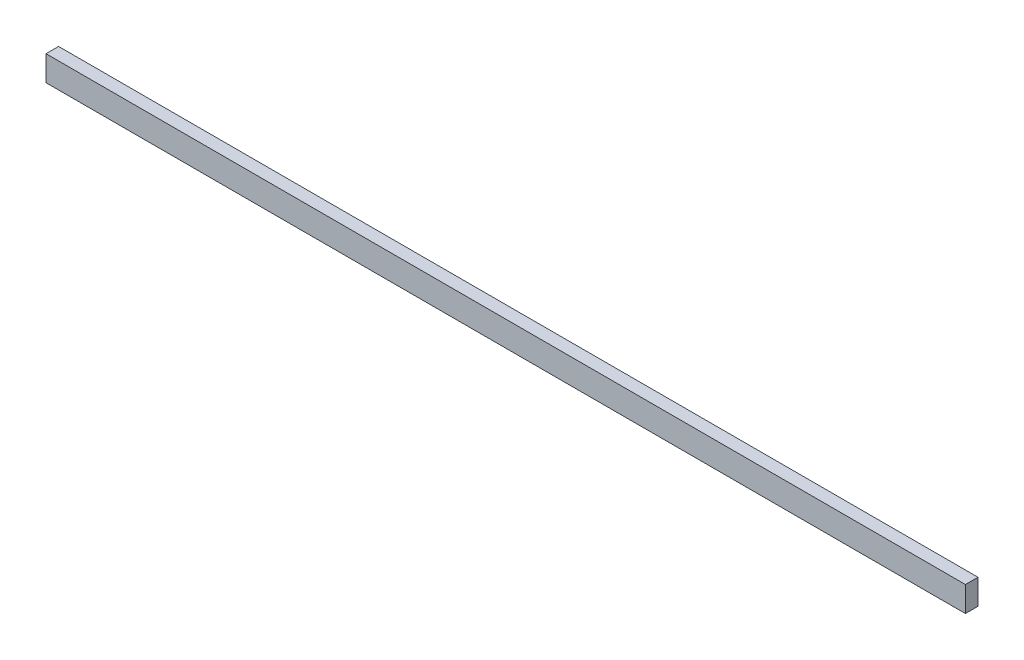
ISO-10303-21;
HEADER;
FILE_DESCRIPTION(('STEP AP214'),'2;1');
FILE_NAME('part.step','',(''),(''),'','','');
FILE_SCHEMA(('AUTOMOTIVE_DESIGN { 1 0 10303 214 1 1 1 1 }'));
ENDSEC;
DATA;
#1=APPLICATION_CONTEXT('core data for automotive mechanical design processes');
#2=APPLICATION_PROTOCOL_DEFINITION('international standard','automotive_design',2000,#1);
#3=PRODUCT_CONTEXT('',#1,'mechanical');
#4=PRODUCT('Part','Part','',(#3));
#5=PRODUCT_RELATED_PRODUCT_CATEGORY('part','',(#4));
#6=PRODUCT_DEFINITION_FORMATION('','',#4);
#7=PRODUCT_DEFINITION_CONTEXT('part definition',#1,'design');
#8=PRODUCT_DEFINITION('design','',#6,#7);
#9=PRODUCT_DEFINITION_SHAPE('','',#8);
#10=(LENGTH_UNIT() NAMED_UNIT(*) SI_UNIT(.MILLI.,.METRE.));
#11=(NAMED_UNIT(*) PLANE_ANGLE_UNIT() SI_UNIT($,.RADIAN.));
#12=(NAMED_UNIT(*) SI_UNIT($,.STERADIAN.) SOLID_ANGLE_UNIT());
#13=UNCERTAINTY_MEASURE_WITH_UNIT(LENGTH_MEASURE(1.E-05),#10,'distance_accuracy_value','');
#14=(GEOMETRIC_REPRESENTATION_CONTEXT(3) GLOBAL_UNCERTAINTY_ASSIGNED_CONTEXT((#13)) GLOBAL_UNIT_ASSIGNED_CONTEXT((#10,
#11,#12)) REPRESENTATION_CONTEXT('',''));
#15=CARTESIAN_POINT('',(0.,0.,0.));
#16=DIRECTION('',(0.,0.,1.));
#17=DIRECTION('',(1.,0.,0.));
#18=AXIS2_PLACEMENT_3D('',#15,#16,#17);
#19=CARTESIAN_POINT('',(548.,15.,15.));
#20=DIRECTION('',(-1.,0.,0.));
#21=DIRECTION('',(0.,0.,1.));
#22=AXIS2_PLACEMENT_3D('',#19,#20,#21);
#23=PLANE('',#22);
#24=DIRECTION('',(0.,1.,0.));
#25=VECTOR('',#24,1.);
#26=CARTESIAN_POINT('',(548.,15.,0.));
#27=LINE('',#26,#25);
#28=CARTESIAN_POINT('',(548.,-15.,0.));
#29=VERTEX_POINT('',#28);
#30=CARTESIAN_POINT('',(548.,15.,0.));
#31=VERTEX_POINT('',#30);
#32=EDGE_CURVE('E96',#29,#31,#27,.T.);
#33=ORIENTED_EDGE('',*,*,#32,.T.);
#34=DIRECTION('',(0.,0.,-1.));
#35=VECTOR('',#34,1.);
#36=CARTESIAN_POINT('',(548.,15.,15.));
#37=LINE('',#36,#35);
#38=CARTESIAN_POINT('',(548.,15.,15.));
#39=VERTEX_POINT('',#38);
#40=EDGE_CURVE('E11',#39,#31,#37,.T.);
#41=ORIENTED_EDGE('',*,*,#40,.F.);
#42=DIRECTION('',(0.,1.,0.));
#43=VECTOR('',#42,1.);
#44=CARTESIAN_POINT('',(548.,15.,15.));
#45=LINE('',#44,#43);
#46=CARTESIAN_POINT('',(548.,-15.,15.));
#47=VERTEX_POINT('',#46);
#48=EDGE_CURVE('E84',#47,#39,#45,.T.);
#49=ORIENTED_EDGE('',*,*,#48,.F.);
#50=DIRECTION('',(0.,0.,-1.));
#51=VECTOR('',#50,1.);
#52=CARTESIAN_POINT('',(548.,-15.,15.));
#53=LINE('',#52,#51);
#54=EDGE_CURVE('E92',#47,#29,#53,.T.);
#55=ORIENTED_EDGE('',*,*,#54,.T.);
#56=EDGE_LOOP('',(#33,#41,#49,#55));
#57=FACE_BOUND('',#56,.T.);
#58=ADVANCED_FACE('F33',(#57),#23,.F.);
#59=CARTESIAN_POINT('',(-548.,15.,15.));
#60=DIRECTION('',(0.,-1.,0.));
#61=DIRECTION('',(0.,0.,-1.));
#62=AXIS2_PLACEMENT_3D('',#59,#60,#61);
#63=PLANE('',#62);
#64=DIRECTION('',(-1.,0.,0.));
#65=VECTOR('',#64,1.);
#66=CARTESIAN_POINT('',(-548.,15.,0.));
#67=LINE('',#66,#65);
#68=CARTESIAN_POINT('',(-548.,15.,0.));
#69=VERTEX_POINT('',#68);
#70=EDGE_CURVE('E88',#31,#69,#67,.T.);
#71=ORIENTED_EDGE('',*,*,#70,.T.);
#72=DIRECTION('',(0.,0.,-1.));
#73=VECTOR('',#72,1.);
#74=CARTESIAN_POINT('',(-548.,15.,15.));
#75=LINE('',#74,#73);
#76=CARTESIAN_POINT('',(-548.,15.,15.));
#77=VERTEX_POINT('',#76);
#78=EDGE_CURVE('E41',#77,#69,#75,.T.);
#79=ORIENTED_EDGE('',*,*,#78,.F.);
#80=DIRECTION('',(-1.,0.,0.));
#81=VECTOR('',#80,1.);
#82=CARTESIAN_POINT('',(-548.,15.,15.));
#83=LINE('',#82,#81);
#84=EDGE_CURVE('E79',#39,#77,#83,.T.);
#85=ORIENTED_EDGE('',*,*,#84,.F.);
#86=ORIENTED_EDGE('',*,*,#40,.T.);
#87=EDGE_LOOP('',(#71,#79,#85,#86));
#88=FACE_BOUND('',#87,.T.);
#89=ADVANCED_FACE('F87',(#88),#63,.F.);
#90=CARTESIAN_POINT('',(-548.,15.,15.));
#91=DIRECTION('',(1.,0.,0.));
#92=DIRECTION('',(0.,0.,-1.));
#93=AXIS2_PLACEMENT_3D('',#90,#91,#92);
#94=PLANE('',#93);
#95=DIRECTION('',(0.,-1.,0.));
#96=VECTOR('',#95,1.);
#97=CARTESIAN_POINT('',(-548.,15.,0.));
#98=LINE('',#97,#96);
#99=CARTESIAN_POINT('',(-548.,-15.,0.));
#100=VERTEX_POINT('',#99);
#101=EDGE_CURVE('E66',#69,#100,#98,.T.);
#102=ORIENTED_EDGE('',*,*,#101,.T.);
#103=DIRECTION('',(0.,0.,-1.));
#104=VECTOR('',#103,1.);
#105=CARTESIAN_POINT('',(-548.,-15.,15.));
#106=LINE('',#105,#104);
#107=CARTESIAN_POINT('',(-548.,-15.,15.));
#108=VERTEX_POINT('',#107);
#109=EDGE_CURVE('E89',#108,#100,#106,.T.);
#110=ORIENTED_EDGE('',*,*,#109,.F.);
#111=DIRECTION('',(0.,-1.,0.));
#112=VECTOR('',#111,1.);
#113=CARTESIAN_POINT('',(-548.,15.,15.));
#114=LINE('',#113,#112);
#115=EDGE_CURVE('E82',#77,#108,#114,.T.);
#116=ORIENTED_EDGE('',*,*,#115,.F.);
#117=ORIENTED_EDGE('',*,*,#78,.T.);
#118=EDGE_LOOP('',(#102,#110,#116,#117));
#119=FACE_BOUND('',#118,.T.);
#120=ADVANCED_FACE('F90',(#119),#94,.F.);
#121=CARTESIAN_POINT('',(-548.,-15.,15.));
#122=DIRECTION('',(0.,1.,0.));
#123=DIRECTION('',(0.,0.,1.));
#124=AXIS2_PLACEMENT_3D('',#121,#122,#123);
#125=PLANE('',#124);
#126=DIRECTION('',(1.,0.,0.));
#127=VECTOR('',#126,1.);
#128=CARTESIAN_POINT('',(-548.,-15.,0.));
#129=LINE('',#128,#127);
#130=EDGE_CURVE('E72',#100,#29,#129,.T.);
#131=ORIENTED_EDGE('',*,*,#130,.T.);
#132=ORIENTED_EDGE('',*,*,#54,.F.);
#133=DIRECTION('',(1.,0.,0.));
#134=VECTOR('',#133,1.);
#135=CARTESIAN_POINT('',(-548.,-15.,15.));
#136=LINE('',#135,#134);
#137=EDGE_CURVE('E49',#108,#47,#136,.T.);
#138=ORIENTED_EDGE('',*,*,#137,.F.);
#139=ORIENTED_EDGE('',*,*,#109,.T.);
#140=EDGE_LOOP('',(#131,#132,#138,#139));
#141=FACE_BOUND('',#140,.T.);
#142=ADVANCED_FACE('F103',(#141),#125,.F.);
#143=CARTESIAN_POINT('',(0.,0.,15.));
#144=DIRECTION('',(0.,0.,1.));
#145=DIRECTION('',(1.,0.,0.));
#146=AXIS2_PLACEMENT_3D('',#143,#144,#145);
#147=PLANE('',#146);
#148=ORIENTED_EDGE('',*,*,#48,.T.);
#149=ORIENTED_EDGE('',*,*,#84,.T.);
#150=ORIENTED_EDGE('',*,*,#115,.T.);
#151=ORIENTED_EDGE('',*,*,#137,.T.);
#152=EDGE_LOOP('',(#148,#149,#150,#151));
#153=FACE_BOUND('',#152,.T.);
#154=ADVANCED_FACE('F80',(#153),#147,.T.);
#155=CARTESIAN_POINT('',(0.,0.,0.));
#156=DIRECTION('',(0.,0.,1.));
#157=DIRECTION('',(1.,0.,0.));
#158=AXIS2_PLACEMENT_3D('',#155,#156,#157);
#159=PLANE('',#158);
#160=ORIENTED_EDGE('',*,*,#32,.F.);
#161=ORIENTED_EDGE('',*,*,#130,.F.);
#162=ORIENTED_EDGE('',*,*,#101,.F.);
#163=ORIENTED_EDGE('',*,*,#70,.F.);
#164=EDGE_LOOP('',(#160,#161,#162,#163));
#165=FACE_BOUND('',#164,.T.);
#166=ADVANCED_FACE('F106',(#165),#159,.F.);
#167=CLOSED_SHELL('',(#58,#89,#120,#142,#154,#166));
#168=MANIFOLD_SOLID_BREP('B2',#167);
#169=ADVANCED_BREP_SHAPE_REPRESENTATION('',(#18,#168),#14);
#170=SHAPE_DEFINITION_REPRESENTATION(#9,#169);
ENDSEC;
END-ISO-10303-21;
